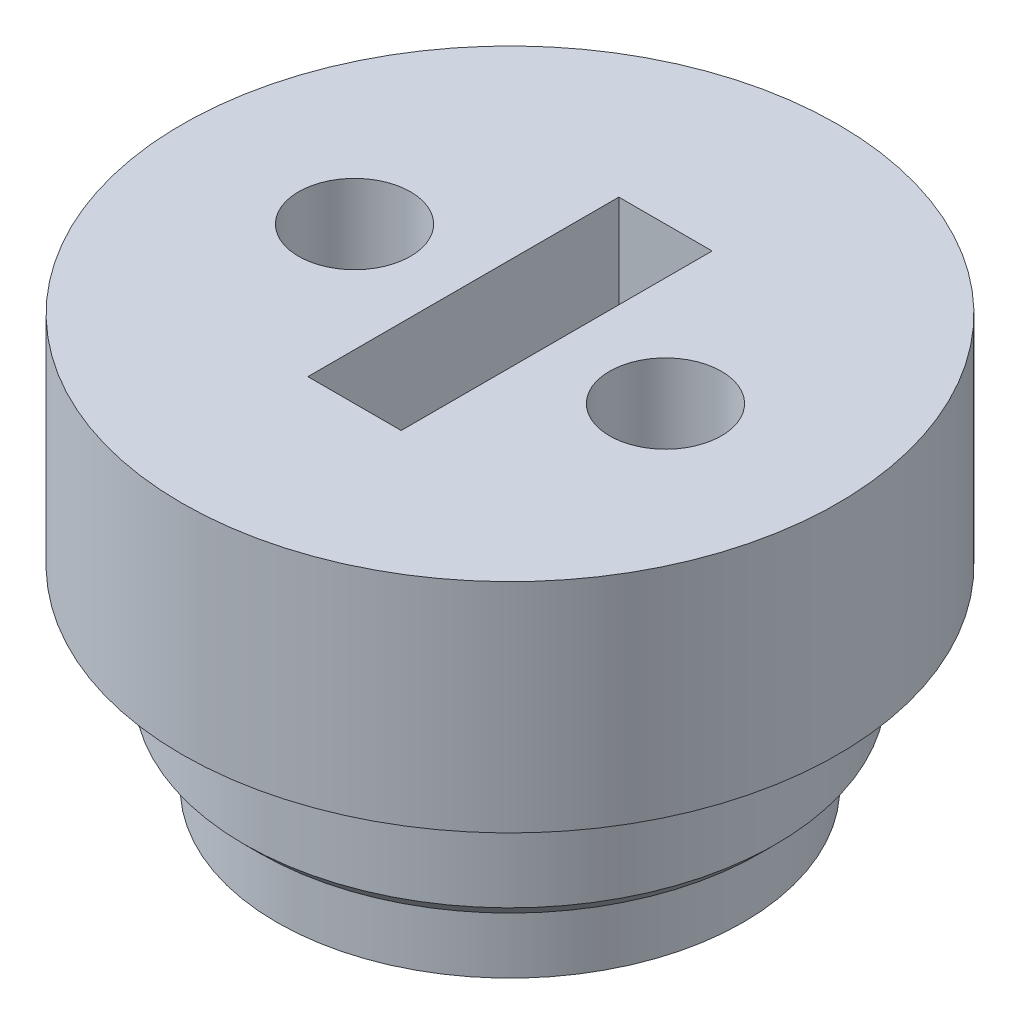
ISO-10303-21;
HEADER;
FILE_DESCRIPTION(('STEP AP214'),'2;1');
FILE_NAME('part.step','',(''),(''),'','','');
FILE_SCHEMA(('AUTOMOTIVE_DESIGN { 1 0 10303 214 1 1 1 1 }'));
ENDSEC;
DATA;
#1=APPLICATION_CONTEXT('core data for automotive mechanical design processes');
#2=APPLICATION_PROTOCOL_DEFINITION('international standard','automotive_design',2000,#1);
#3=PRODUCT_CONTEXT('',#1,'mechanical');
#4=PRODUCT('Part','Part','',(#3));
#5=PRODUCT_RELATED_PRODUCT_CATEGORY('part','',(#4));
#6=PRODUCT_DEFINITION_FORMATION('','',#4);
#7=PRODUCT_DEFINITION_CONTEXT('part definition',#1,'design');
#8=PRODUCT_DEFINITION('design','',#6,#7);
#9=PRODUCT_DEFINITION_SHAPE('','',#8);
#10=(LENGTH_UNIT() NAMED_UNIT(*) SI_UNIT(.MILLI.,.METRE.));
#11=(NAMED_UNIT(*) PLANE_ANGLE_UNIT() SI_UNIT($,.RADIAN.));
#12=(NAMED_UNIT(*) SI_UNIT($,.STERADIAN.) SOLID_ANGLE_UNIT());
#13=UNCERTAINTY_MEASURE_WITH_UNIT(LENGTH_MEASURE(1.E-05),#10,'distance_accuracy_value','');
#14=(GEOMETRIC_REPRESENTATION_CONTEXT(3) GLOBAL_UNCERTAINTY_ASSIGNED_CONTEXT((#13)) GLOBAL_UNIT_ASSIGNED_CONTEXT((#10,
#11,#12)) REPRESENTATION_CONTEXT('',''));
#15=CARTESIAN_POINT('',(0.,0.,0.));
#16=DIRECTION('',(0.,0.,1.));
#17=DIRECTION('',(1.,0.,0.));
#18=AXIS2_PLACEMENT_3D('',#15,#16,#17);
#19=CARTESIAN_POINT('',(0.,0.,0.));
#20=DIRECTION('',(0.,1.,0.));
#21=DIRECTION('',(0.,0.,1.));
#22=AXIS2_PLACEMENT_3D('',#19,#20,#21);
#23=PLANE('',#22);
#24=CARTESIAN_POINT('',(0.,0.,0.));
#25=DIRECTION('',(0.,1.,0.));
#26=DIRECTION('',(0.,0.,1.));
#27=AXIS2_PLACEMENT_3D('',#24,#25,#26);
#28=CIRCLE('',#27,8.05);
#29=CARTESIAN_POINT('',(0.,0.,8.05));
#30=VERTEX_POINT('',#29);
#31=EDGE_CURVE('E11',#30,#30,#28,.F.);
#32=ORIENTED_EDGE('',*,*,#31,.T.);
#33=EDGE_LOOP('',(#32));
#34=FACE_BOUND('',#33,.T.);
#35=CARTESIAN_POINT('',(0.,0.,0.));
#36=DIRECTION('',(0.,-1.,0.));
#37=DIRECTION('',(0.,0.,-1.));
#38=AXIS2_PLACEMENT_3D('',#35,#36,#37);
#39=CIRCLE('',#38,7.5);
#40=CARTESIAN_POINT('',(0.,0.,-7.5));
#41=VERTEX_POINT('',#40);
#42=EDGE_CURVE('E111',#41,#41,#39,.T.);
#43=ORIENTED_EDGE('',*,*,#42,.F.);
#44=EDGE_LOOP('',(#43));
#45=FACE_BOUND('',#44,.T.);
#46=ADVANCED_FACE('F37',(#34,#45),#23,.F.);
#47=CARTESIAN_POINT('',(0.,4.,0.));
#48=DIRECTION('',(0.,-1.,0.));
#49=DIRECTION('',(0.,0.,-1.));
#50=AXIS2_PLACEMENT_3D('',#47,#48,#49);
#51=CYLINDRICAL_SURFACE('',#50,8.55);
#52=CARTESIAN_POINT('',(0.,0.500000000000004,0.));
#53=DIRECTION('',(0.,1.,0.));
#54=DIRECTION('',(0.,0.,1.));
#55=AXIS2_PLACEMENT_3D('',#52,#53,#54);
#56=CIRCLE('',#55,8.55);
#57=CARTESIAN_POINT('',(0.,0.500000000000004,8.55));
#58=VERTEX_POINT('',#57);
#59=EDGE_CURVE('E46',#58,#58,#56,.T.);
#60=ORIENTED_EDGE('',*,*,#59,.T.);
#61=EDGE_LOOP('',(#60));
#62=FACE_BOUND('',#61,.T.);
#63=CARTESIAN_POINT('',(0.,4.,0.));
#64=DIRECTION('',(0.,1.,0.));
#65=DIRECTION('',(0.,0.,1.));
#66=AXIS2_PLACEMENT_3D('',#63,#64,#65);
#67=CIRCLE('',#66,8.55);
#68=CARTESIAN_POINT('',(0.,4.,8.55));
#69=VERTEX_POINT('',#68);
#70=EDGE_CURVE('E114',#69,#69,#67,.T.);
#71=ORIENTED_EDGE('',*,*,#70,.F.);
#72=EDGE_LOOP('',(#71));
#73=FACE_BOUND('',#72,.T.);
#74=ADVANCED_FACE('F134',(#62,#73),#51,.T.);
#75=CARTESIAN_POINT('',(1.5,4.,5.));
#76=DIRECTION('',(-1.,0.,0.));
#77=DIRECTION('',(0.,0.,1.));
#78=AXIS2_PLACEMENT_3D('',#75,#76,#77);
#79=PLANE('',#78);
#80=DIRECTION('',(0.,-1.,0.));
#81=VECTOR('',#80,1.);
#82=CARTESIAN_POINT('',(1.5,4.,-5.));
#83=LINE('',#82,#81);
#84=CARTESIAN_POINT('',(1.5,11.,-5.));
#85=VERTEX_POINT('',#84);
#86=CARTESIAN_POINT('',(1.5,-2.2,-5.));
#87=VERTEX_POINT('',#86);
#88=EDGE_CURVE('E61',#85,#87,#83,.T.);
#89=ORIENTED_EDGE('',*,*,#88,.T.);
#90=DIRECTION('',(0.,0.,1.));
#91=VECTOR('',#90,1.);
#92=CARTESIAN_POINT('',(1.5,-2.2,5.));
#93=LINE('',#92,#91);
#94=CARTESIAN_POINT('',(1.5,-2.2,5.));
#95=VERTEX_POINT('',#94);
#96=EDGE_CURVE('E102',#87,#95,#93,.T.);
#97=ORIENTED_EDGE('',*,*,#96,.T.);
#98=DIRECTION('',(0.,-1.,0.));
#99=VECTOR('',#98,1.);
#100=CARTESIAN_POINT('',(1.5,4.,5.));
#101=LINE('',#100,#99);
#102=CARTESIAN_POINT('',(1.5,11.,5.));
#103=VERTEX_POINT('',#102);
#104=EDGE_CURVE('E53',#103,#95,#101,.T.);
#105=ORIENTED_EDGE('',*,*,#104,.F.);
#106=DIRECTION('',(0.,0.,-1.));
#107=VECTOR('',#106,1.);
#108=CARTESIAN_POINT('',(1.5,11.,5.));
#109=LINE('',#108,#107);
#110=EDGE_CURVE('E119',#103,#85,#109,.T.);
#111=ORIENTED_EDGE('',*,*,#110,.T.);
#112=EDGE_LOOP('',(#89,#97,#105,#111));
#113=FACE_BOUND('',#112,.T.);
#114=ADVANCED_FACE('F157',(#113),#79,.T.);
#115=CARTESIAN_POINT('',(-1.5,4.,-5.));
#116=DIRECTION('',(0.,0.,1.));
#117=DIRECTION('',(1.,0.,0.));
#118=AXIS2_PLACEMENT_3D('',#115,#116,#117);
#119=PLANE('',#118);
#120=DIRECTION('',(0.,-1.,0.));
#121=VECTOR('',#120,1.);
#122=CARTESIAN_POINT('',(-1.5,4.,-5.));
#123=LINE('',#122,#121);
#124=CARTESIAN_POINT('',(-1.5,11.,-5.));
#125=VERTEX_POINT('',#124);
#126=CARTESIAN_POINT('',(-1.5,-2.2,-5.));
#127=VERTEX_POINT('',#126);
#128=EDGE_CURVE('E90',#125,#127,#123,.T.);
#129=ORIENTED_EDGE('',*,*,#128,.T.);
#130=DIRECTION('',(1.,0.,0.));
#131=VECTOR('',#130,1.);
#132=CARTESIAN_POINT('',(1.5,-2.2,-5.));
#133=LINE('',#132,#131);
#134=EDGE_CURVE('E100',#127,#87,#133,.T.);
#135=ORIENTED_EDGE('',*,*,#134,.T.);
#136=ORIENTED_EDGE('',*,*,#88,.F.);
#137=DIRECTION('',(-1.,0.,0.));
#138=VECTOR('',#137,1.);
#139=CARTESIAN_POINT('',(1.5,11.,-5.));
#140=LINE('',#139,#138);
#141=EDGE_CURVE('E110',#85,#125,#140,.T.);
#142=ORIENTED_EDGE('',*,*,#141,.T.);
#143=EDGE_LOOP('',(#129,#135,#136,#142));
#144=FACE_BOUND('',#143,.T.);
#145=ADVANCED_FACE('F162',(#144),#119,.T.);
#146=CARTESIAN_POINT('',(-1.5,4.,5.));
#147=DIRECTION('',(1.,0.,0.));
#148=DIRECTION('',(0.,0.,-1.));
#149=AXIS2_PLACEMENT_3D('',#146,#147,#148);
#150=PLANE('',#149);
#151=DIRECTION('',(0.,-1.,0.));
#152=VECTOR('',#151,1.);
#153=CARTESIAN_POINT('',(-1.5,4.,5.));
#154=LINE('',#153,#152);
#155=CARTESIAN_POINT('',(-1.5,11.,5.));
#156=VERTEX_POINT('',#155);
#157=CARTESIAN_POINT('',(-1.5,-2.2,5.));
#158=VERTEX_POINT('',#157);
#159=EDGE_CURVE('E80',#156,#158,#154,.T.);
#160=ORIENTED_EDGE('',*,*,#159,.T.);
#161=DIRECTION('',(0.,0.,-1.));
#162=VECTOR('',#161,1.);
#163=CARTESIAN_POINT('',(-1.5,-2.2,-5.));
#164=LINE('',#163,#162);
#165=EDGE_CURVE('E84',#158,#127,#164,.T.);
#166=ORIENTED_EDGE('',*,*,#165,.T.);
#167=ORIENTED_EDGE('',*,*,#128,.F.);
#168=DIRECTION('',(0.,0.,1.));
#169=VECTOR('',#168,1.);
#170=CARTESIAN_POINT('',(-1.5,11.,-5.));
#171=LINE('',#170,#169);
#172=EDGE_CURVE('E87',#125,#156,#171,.T.);
#173=ORIENTED_EDGE('',*,*,#172,.T.);
#174=EDGE_LOOP('',(#160,#166,#167,#173));
#175=FACE_BOUND('',#174,.T.);
#176=ADVANCED_FACE('F82',(#175),#150,.T.);
#177=CARTESIAN_POINT('',(-1.5,4.,5.));
#178=DIRECTION('',(0.,0.,-1.));
#179=DIRECTION('',(-1.,0.,0.));
#180=AXIS2_PLACEMENT_3D('',#177,#178,#179);
#181=PLANE('',#180);
#182=ORIENTED_EDGE('',*,*,#104,.T.);
#183=DIRECTION('',(-1.,0.,0.));
#184=VECTOR('',#183,1.);
#185=CARTESIAN_POINT('',(-1.5,-2.2,5.));
#186=LINE('',#185,#184);
#187=EDGE_CURVE('E93',#95,#158,#186,.T.);
#188=ORIENTED_EDGE('',*,*,#187,.T.);
#189=ORIENTED_EDGE('',*,*,#159,.F.);
#190=DIRECTION('',(1.,0.,0.));
#191=VECTOR('',#190,1.);
#192=CARTESIAN_POINT('',(-1.5,11.,5.));
#193=LINE('',#192,#191);
#194=EDGE_CURVE('E117',#156,#103,#193,.T.);
#195=ORIENTED_EDGE('',*,*,#194,.T.);
#196=EDGE_LOOP('',(#182,#188,#189,#195));
#197=FACE_BOUND('',#196,.T.);
#198=ADVANCED_FACE('F94',(#197),#181,.T.);
#199=CARTESIAN_POINT('',(0.,11.,0.));
#200=DIRECTION('',(0.,1.,0.));
#201=DIRECTION('',(0.,0.,1.));
#202=AXIS2_PLACEMENT_3D('',#199,#200,#201);
#203=PLANE('',#202);
#204=CARTESIAN_POINT('',(-5.,11.,0.));
#205=DIRECTION('',(0.,-1.,0.));
#206=DIRECTION('',(0.,0.,-1.));
#207=AXIS2_PLACEMENT_3D('',#204,#205,#206);
#208=CIRCLE('',#207,1.8);
#209=CARTESIAN_POINT('',(-5.,11.,-1.8));
#210=VERTEX_POINT('',#209);
#211=EDGE_CURVE('E198',#210,#210,#208,.T.);
#212=ORIENTED_EDGE('',*,*,#211,.T.);
#213=EDGE_LOOP('',(#212));
#214=FACE_BOUND('',#213,.T.);
#215=CARTESIAN_POINT('',(5.,11.,0.));
#216=DIRECTION('',(0.,-1.,0.));
#217=DIRECTION('',(0.,0.,-1.));
#218=AXIS2_PLACEMENT_3D('',#215,#216,#217);
#219=CIRCLE('',#218,1.8);
#220=CARTESIAN_POINT('',(5.,11.,-1.8));
#221=VERTEX_POINT('',#220);
#222=EDGE_CURVE('E205',#221,#221,#219,.T.);
#223=ORIENTED_EDGE('',*,*,#222,.T.);
#224=EDGE_LOOP('',(#223));
#225=FACE_BOUND('',#224,.T.);
#226=CARTESIAN_POINT('',(0.,11.,0.));
#227=DIRECTION('',(0.,1.,0.));
#228=DIRECTION('',(0.,0.,1.));
#229=AXIS2_PLACEMENT_3D('',#226,#227,#228);
#230=CIRCLE('',#229,10.55);
#231=CARTESIAN_POINT('',(0.,11.,10.55));
#232=VERTEX_POINT('',#231);
#233=EDGE_CURVE('E122',#232,#232,#230,.T.);
#234=ORIENTED_EDGE('',*,*,#233,.T.);
#235=EDGE_LOOP('',(#234));
#236=FACE_BOUND('',#235,.T.);
#237=ORIENTED_EDGE('',*,*,#172,.F.);
#238=ORIENTED_EDGE('',*,*,#141,.F.);
#239=ORIENTED_EDGE('',*,*,#110,.F.);
#240=ORIENTED_EDGE('',*,*,#194,.F.);
#241=EDGE_LOOP('',(#237,#238,#239,#240));
#242=FACE_BOUND('',#241,.T.);
#243=ADVANCED_FACE('F169',(#214,#225,#236,#242),#203,.T.);
#244=CARTESIAN_POINT('',(0.,4.,0.));
#245=DIRECTION('',(0.,1.,0.));
#246=DIRECTION('',(0.,0.,1.));
#247=AXIS2_PLACEMENT_3D('',#244,#245,#246);
#248=PLANE('',#247);
#249=ORIENTED_EDGE('',*,*,#70,.T.);
#250=EDGE_LOOP('',(#249));
#251=FACE_BOUND('',#250,.T.);
#252=CARTESIAN_POINT('',(0.,4.,0.));
#253=DIRECTION('',(0.,1.,0.));
#254=DIRECTION('',(0.,0.,1.));
#255=AXIS2_PLACEMENT_3D('',#252,#253,#254);
#256=CIRCLE('',#255,10.55);
#257=CARTESIAN_POINT('',(0.,4.,10.55));
#258=VERTEX_POINT('',#257);
#259=EDGE_CURVE('E121',#258,#258,#256,.T.);
#260=ORIENTED_EDGE('',*,*,#259,.F.);
#261=EDGE_LOOP('',(#260));
#262=FACE_BOUND('',#261,.T.);
#263=ADVANCED_FACE('F173',(#251,#262),#248,.F.);
#264=CARTESIAN_POINT('',(0.,11.,0.));
#265=DIRECTION('',(0.,-1.,0.));
#266=DIRECTION('',(0.,0.,-1.));
#267=AXIS2_PLACEMENT_3D('',#264,#265,#266);
#268=CYLINDRICAL_SURFACE('',#267,10.55);
#269=ORIENTED_EDGE('',*,*,#233,.F.);
#270=EDGE_LOOP('',(#269));
#271=FACE_BOUND('',#270,.T.);
#272=ORIENTED_EDGE('',*,*,#259,.T.);
#273=EDGE_LOOP('',(#272));
#274=FACE_BOUND('',#273,.T.);
#275=ADVANCED_FACE('F170',(#271,#274),#268,.T.);
#276=CARTESIAN_POINT('',(0.,-2.2,0.));
#277=DIRECTION('',(0.,-1.,0.));
#278=DIRECTION('',(0.,0.,-1.));
#279=AXIS2_PLACEMENT_3D('',#276,#277,#278);
#280=PLANE('',#279);
#281=CARTESIAN_POINT('',(0.,-2.2,0.));
#282=DIRECTION('',(0.,-1.,0.));
#283=DIRECTION('',(0.,0.,-1.));
#284=AXIS2_PLACEMENT_3D('',#281,#282,#283);
#285=CIRCLE('',#284,7.5);
#286=CARTESIAN_POINT('',(0.,-2.2,-7.5));
#287=VERTEX_POINT('',#286);
#288=EDGE_CURVE('E107',#287,#287,#285,.T.);
#289=ORIENTED_EDGE('',*,*,#288,.T.);
#290=EDGE_LOOP('',(#289));
#291=FACE_BOUND('',#290,.T.);
#292=ORIENTED_EDGE('',*,*,#165,.F.);
#293=ORIENTED_EDGE('',*,*,#187,.F.);
#294=ORIENTED_EDGE('',*,*,#96,.F.);
#295=ORIENTED_EDGE('',*,*,#134,.F.);
#296=EDGE_LOOP('',(#292,#293,#294,#295));
#297=FACE_BOUND('',#296,.T.);
#298=ADVANCED_FACE('F99',(#291,#297),#280,.T.);
#299=CARTESIAN_POINT('',(0.,-2.2,0.));
#300=DIRECTION('',(0.,1.,0.));
#301=DIRECTION('',(0.,0.,1.));
#302=AXIS2_PLACEMENT_3D('',#299,#300,#301);
#303=CYLINDRICAL_SURFACE('',#302,7.5);
#304=ORIENTED_EDGE('',*,*,#288,.F.);
#305=EDGE_LOOP('',(#304));
#306=FACE_BOUND('',#305,.T.);
#307=ORIENTED_EDGE('',*,*,#42,.T.);
#308=EDGE_LOOP('',(#307));
#309=FACE_BOUND('',#308,.T.);
#310=ADVANCED_FACE('F139',(#306,#309),#303,.T.);
#311=CARTESIAN_POINT('',(0.,0.500000000000004,0.));
#312=DIRECTION('',(0.,1.,0.));
#313=DIRECTION('',(0.,0.,1.));
#314=AXIS2_PLACEMENT_3D('',#311,#312,#313);
#315=CONICAL_SURFACE('',#314,8.55,0.78539816339745);
#316=ORIENTED_EDGE('',*,*,#31,.F.);
#317=EDGE_LOOP('',(#316));
#318=FACE_BOUND('',#317,.T.);
#319=ORIENTED_EDGE('',*,*,#59,.F.);
#320=EDGE_LOOP('',(#319));
#321=FACE_BOUND('',#320,.T.);
#322=ADVANCED_FACE('F40',(#318,#321),#315,.T.);
#323=CARTESIAN_POINT('',(5.,0.999999999999999,0.));
#324=DIRECTION('',(0.,1.,0.));
#325=DIRECTION('',(0.,0.,1.));
#326=AXIS2_PLACEMENT_3D('',#323,#324,#325);
#327=CYLINDRICAL_SURFACE('',#326,1.8);
#328=CARTESIAN_POINT('',(5.,0.999999999999999,0.));
#329=DIRECTION('',(0.,-1.,0.));
#330=DIRECTION('',(0.,0.,-1.));
#331=AXIS2_PLACEMENT_3D('',#328,#329,#330);
#332=CIRCLE('',#331,1.8);
#333=CARTESIAN_POINT('',(5.,0.999999999999999,-1.8));
#334=VERTEX_POINT('',#333);
#335=EDGE_CURVE('E201',#334,#334,#332,.T.);
#336=ORIENTED_EDGE('',*,*,#335,.T.);
#337=EDGE_LOOP('',(#336));
#338=FACE_BOUND('',#337,.T.);
#339=ORIENTED_EDGE('',*,*,#222,.F.);
#340=EDGE_LOOP('',(#339));
#341=FACE_BOUND('',#340,.T.);
#342=ADVANCED_FACE('F138',(#338,#341),#327,.F.);
#343=CARTESIAN_POINT('',(5.,0.999999999999999,0.));
#344=DIRECTION('',(0.,-1.,0.));
#345=DIRECTION('',(0.,0.,-1.));
#346=AXIS2_PLACEMENT_3D('',#343,#344,#345);
#347=PLANE('',#346);
#348=ORIENTED_EDGE('',*,*,#335,.F.);
#349=EDGE_LOOP('',(#348));
#350=FACE_BOUND('',#349,.T.);
#351=ADVANCED_FACE('F145',(#350),#347,.F.);
#352=CARTESIAN_POINT('',(-5.,0.999999999999999,0.));
#353=DIRECTION('',(0.,1.,0.));
#354=DIRECTION('',(0.,0.,1.));
#355=AXIS2_PLACEMENT_3D('',#352,#353,#354);
#356=CYLINDRICAL_SURFACE('',#355,1.8);
#357=CARTESIAN_POINT('',(-5.,0.999999999999999,0.));
#358=DIRECTION('',(0.,-1.,0.));
#359=DIRECTION('',(0.,0.,-1.));
#360=AXIS2_PLACEMENT_3D('',#357,#358,#359);
#361=CIRCLE('',#360,1.8);
#362=CARTESIAN_POINT('',(-5.,0.999999999999999,-1.8));
#363=VERTEX_POINT('',#362);
#364=EDGE_CURVE('E97',#363,#363,#361,.T.);
#365=ORIENTED_EDGE('',*,*,#364,.T.);
#366=EDGE_LOOP('',(#365));
#367=FACE_BOUND('',#366,.T.);
#368=ORIENTED_EDGE('',*,*,#211,.F.);
#369=EDGE_LOOP('',(#368));
#370=FACE_BOUND('',#369,.T.);
#371=ADVANCED_FACE('F186',(#367,#370),#356,.F.);
#372=CARTESIAN_POINT('',(-5.,0.999999999999999,0.));
#373=DIRECTION('',(0.,-1.,0.));
#374=DIRECTION('',(0.,0.,-1.));
#375=AXIS2_PLACEMENT_3D('',#372,#373,#374);
#376=PLANE('',#375);
#377=ORIENTED_EDGE('',*,*,#364,.F.);
#378=EDGE_LOOP('',(#377));
#379=FACE_BOUND('',#378,.T.);
#380=ADVANCED_FACE('F190',(#379),#376,.F.);
#381=CLOSED_SHELL('',(#46,#74,#114,#145,#176,#198,#243,#263,#275,#298,#310,#322,#342,#351,#371,#380));
#382=MANIFOLD_SOLID_BREP('B2',#381);
#383=ADVANCED_BREP_SHAPE_REPRESENTATION('',(#18,#382),#14);
#384=SHAPE_DEFINITION_REPRESENTATION(#9,#383);
ENDSEC;
END-ISO-10303-21;
